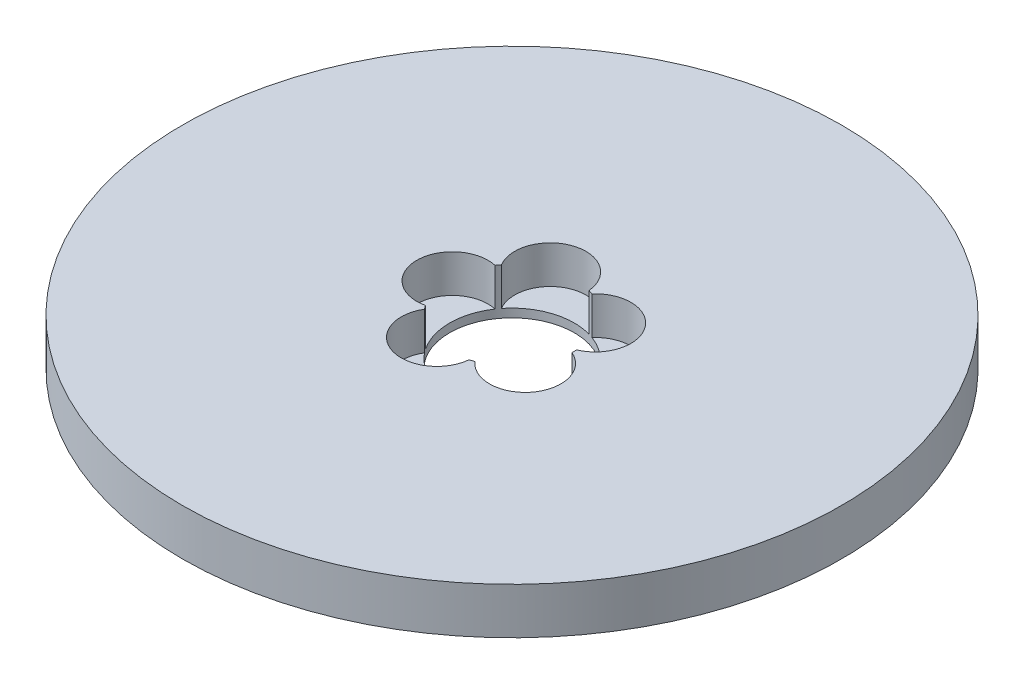
ISO-10303-21;
HEADER;
FILE_DESCRIPTION(('STEP AP214'),'2;1');
FILE_NAME('part.step','',(''),(''),'','','');
FILE_SCHEMA(('AUTOMOTIVE_DESIGN { 1 0 10303 214 1 1 1 1 }'));
ENDSEC;
DATA;
#1=APPLICATION_CONTEXT('core data for automotive mechanical design processes');
#2=APPLICATION_PROTOCOL_DEFINITION('international standard','automotive_design',2000,#1);
#3=PRODUCT_CONTEXT('',#1,'mechanical');
#4=PRODUCT('Part','Part','',(#3));
#5=PRODUCT_RELATED_PRODUCT_CATEGORY('part','',(#4));
#6=PRODUCT_DEFINITION_FORMATION('','',#4);
#7=PRODUCT_DEFINITION_CONTEXT('part definition',#1,'design');
#8=PRODUCT_DEFINITION('design','',#6,#7);
#9=PRODUCT_DEFINITION_SHAPE('','',#8);
#10=(LENGTH_UNIT() NAMED_UNIT(*) SI_UNIT(.MILLI.,.METRE.));
#11=(NAMED_UNIT(*) PLANE_ANGLE_UNIT() SI_UNIT($,.RADIAN.));
#12=(NAMED_UNIT(*) SI_UNIT($,.STERADIAN.) SOLID_ANGLE_UNIT());
#13=UNCERTAINTY_MEASURE_WITH_UNIT(LENGTH_MEASURE(1.E-05),#10,'distance_accuracy_value','');
#14=(GEOMETRIC_REPRESENTATION_CONTEXT(3) GLOBAL_UNCERTAINTY_ASSIGNED_CONTEXT((#13)) GLOBAL_UNIT_ASSIGNED_CONTEXT((#10,
#11,#12)) REPRESENTATION_CONTEXT('',''));
#15=CARTESIAN_POINT('',(0.,0.,0.));
#16=DIRECTION('',(0.,0.,1.));
#17=DIRECTION('',(1.,0.,0.));
#18=AXIS2_PLACEMENT_3D('',#15,#16,#17);
#19=CARTESIAN_POINT('',(0.,13.,0.));
#20=DIRECTION('',(0.,-1.,0.));
#21=DIRECTION('',(0.,0.,-1.));
#22=AXIS2_PLACEMENT_3D('',#19,#20,#21);
#23=CYLINDRICAL_SURFACE('',#22,92.5);
#24=CARTESIAN_POINT('',(0.,13.,0.));
#25=DIRECTION('',(0.,1.,0.));
#26=DIRECTION('',(0.,0.,1.));
#27=AXIS2_PLACEMENT_3D('',#24,#25,#26);
#28=CIRCLE('',#27,92.5);
#29=CARTESIAN_POINT('',(0.,13.,-92.5));
#30=VERTEX_POINT('',#29);
#31=EDGE_CURVE('E187',#30,#30,#28,.T.);
#32=CARTESIAN_POINT('',(0.,0.,0.));
#33=DIRECTION('',(0.,1.,0.));
#34=DIRECTION('',(0.,0.,1.));
#35=AXIS2_PLACEMENT_3D('',#32,#33,#34);
#36=CIRCLE('',#35,92.5);
#37=CARTESIAN_POINT('',(0.,0.,-92.5));
#38=VERTEX_POINT('',#37);
#39=EDGE_CURVE('E181',#38,#38,#36,.T.);
#40=CARTESIAN_POINT('',(0.,13.,-92.5));
#41=CARTESIAN_POINT('',(0.,12.8645833333333,-92.5));
#42=CARTESIAN_POINT('',(0.,12.7291666666667,-92.5));
#43=CARTESIAN_POINT('',(0.,12.4583333333333,-92.5));
#44=CARTESIAN_POINT('',(0.,12.3229166666667,-92.5));
#45=CARTESIAN_POINT('',(0.,12.0520833333333,-92.5));
#46=CARTESIAN_POINT('',(0.,11.9166666666667,-92.5));
#47=CARTESIAN_POINT('',(0.,11.6458333333333,-92.5));
#48=CARTESIAN_POINT('',(0.,11.5104166666667,-92.5));
#49=CARTESIAN_POINT('',(0.,11.2395833333333,-92.5));
#50=CARTESIAN_POINT('',(0.,11.1041666666667,-92.5));
#51=CARTESIAN_POINT('',(0.,10.8333333333333,-92.5));
#52=CARTESIAN_POINT('',(0.,10.6979166666667,-92.5));
#53=CARTESIAN_POINT('',(0.,10.4270833333333,-92.5));
#54=CARTESIAN_POINT('',(0.,10.2916666666667,-92.5));
#55=CARTESIAN_POINT('',(0.,10.0208333333333,-92.5));
#56=CARTESIAN_POINT('',(0.,9.88541666666667,-92.5));
#57=CARTESIAN_POINT('',(0.,9.61458333333333,-92.5));
#58=CARTESIAN_POINT('',(0.,9.47916666666667,-92.5));
#59=CARTESIAN_POINT('',(0.,9.20833333333333,-92.5));
#60=CARTESIAN_POINT('',(0.,9.07291666666666,-92.5));
#61=CARTESIAN_POINT('',(0.,8.80208333333333,-92.5));
#62=CARTESIAN_POINT('',(0.,8.66666666666667,-92.5));
#63=CARTESIAN_POINT('',(0.,8.39583333333333,-92.5));
#64=CARTESIAN_POINT('',(0.,8.26041666666667,-92.5));
#65=CARTESIAN_POINT('',(0.,7.98958333333333,-92.5));
#66=CARTESIAN_POINT('',(0.,7.85416666666667,-92.5));
#67=CARTESIAN_POINT('',(0.,7.58333333333333,-92.5));
#68=CARTESIAN_POINT('',(0.,7.44791666666667,-92.5));
#69=CARTESIAN_POINT('',(0.,7.17708333333333,-92.5));
#70=CARTESIAN_POINT('',(0.,7.04166666666667,-92.5));
#71=CARTESIAN_POINT('',(0.,6.77083333333333,-92.5));
#72=CARTESIAN_POINT('',(0.,6.63541666666667,-92.5));
#73=CARTESIAN_POINT('',(0.,6.36458333333333,-92.5));
#74=CARTESIAN_POINT('',(0.,6.22916666666667,-92.5));
#75=CARTESIAN_POINT('',(0.,5.95833333333333,-92.5));
#76=CARTESIAN_POINT('',(0.,5.82291666666667,-92.5));
#77=CARTESIAN_POINT('',(0.,5.55208333333333,-92.5));
#78=CARTESIAN_POINT('',(0.,5.41666666666667,-92.5));
#79=CARTESIAN_POINT('',(0.,5.14583333333333,-92.5));
#80=CARTESIAN_POINT('',(0.,5.01041666666667,-92.5));
#81=CARTESIAN_POINT('',(0.,4.73958333333333,-92.5));
#82=CARTESIAN_POINT('',(0.,4.60416666666667,-92.5));
#83=CARTESIAN_POINT('',(0.,4.33333333333333,-92.5));
#84=CARTESIAN_POINT('',(0.,4.19791666666667,-92.5));
#85=CARTESIAN_POINT('',(0.,3.92708333333333,-92.5));
#86=CARTESIAN_POINT('',(0.,3.79166666666667,-92.5));
#87=CARTESIAN_POINT('',(0.,3.52083333333333,-92.5));
#88=CARTESIAN_POINT('',(0.,3.38541666666667,-92.5));
#89=CARTESIAN_POINT('',(0.,3.11458333333333,-92.5));
#90=CARTESIAN_POINT('',(0.,2.97916666666667,-92.5));
#91=CARTESIAN_POINT('',(0.,2.70833333333333,-92.5));
#92=CARTESIAN_POINT('',(0.,2.57291666666667,-92.5));
#93=CARTESIAN_POINT('',(0.,2.30208333333333,-92.5));
#94=CARTESIAN_POINT('',(0.,2.16666666666667,-92.5));
#95=CARTESIAN_POINT('',(0.,1.89583333333333,-92.5));
#96=CARTESIAN_POINT('',(0.,1.76041666666667,-92.5));
#97=CARTESIAN_POINT('',(0.,1.48958333333333,-92.5));
#98=CARTESIAN_POINT('',(0.,1.35416666666667,-92.5));
#99=CARTESIAN_POINT('',(0.,1.08333333333333,-92.5));
#100=CARTESIAN_POINT('',(0.,0.947916666666667,-92.5));
#101=CARTESIAN_POINT('',(0.,0.677083333333334,-92.5));
#102=CARTESIAN_POINT('',(0.,0.541666666666667,-92.5));
#103=CARTESIAN_POINT('',(0.,0.270833333333334,-92.5));
#104=CARTESIAN_POINT('',(0.,0.135416666666667,-92.5));
#105=CARTESIAN_POINT('',(0.,0.,-92.5));
#106=B_SPLINE_CURVE_WITH_KNOTS('',3,(#40,#41,#42,#43,#44,#45,#46,#47,#48,#49,#50,#51,#52,#53,
#54,#55,#56,#57,#58,#59,#60,#61,#62,#63,#64,#65,#66,#67,#68,#69,#70,#71,#72,#73,#74,#75,#76,#77,
#78,#79,#80,#81,#82,#83,#84,#85,#86,#87,#88,#89,#90,#91,#92,#93,#94,#95,#96,#97,#98,#99,#100,
#101,#102,#103,#104,#105),.UNSPECIFIED.,.F.,.F.,(4,2,2,2,2,2,2,2,2,2,2,2,2,2,2,2,2,2,2,2,2,2,2,
2,2,2,2,2,2,2,2,2,4),(0.,0.40625,0.812500000000001,1.21875,1.625,2.03125,2.4375,2.84375,3.25,
3.65625,4.0625,4.46875,4.875,5.28125,5.6875,6.09375,6.5,6.90625,7.3125,7.71875,8.125,8.53125,
8.9375,9.34375,9.75,10.15625,10.5625,10.96875,11.375,11.78125,12.1875,12.59375,13.),.UNSPECIFIED.);
#107=EDGE_CURVE('BSEAM39',#30,#38,#106,.T.);
#108=ORIENTED_EDGE('',*,*,#31,.F.);
#109=ORIENTED_EDGE('',*,*,#39,.T.);
#110=ORIENTED_EDGE('',*,*,#107,.T.);
#111=ORIENTED_EDGE('',*,*,#107,.F.);
#112=EDGE_LOOP('',(#108,#110,#109,#111));
#113=FACE_BOUND('',#112,.T.);
#114=ADVANCED_FACE('F39',(#113),#23,.T.);
#115=CARTESIAN_POINT('',(0.,13.,0.));
#116=DIRECTION('',(0.,1.,0.));
#117=DIRECTION('',(0.,0.,1.));
#118=AXIS2_PLACEMENT_3D('',#115,#116,#117);
#119=PLANE('',#118);
#120=CARTESIAN_POINT('',(-5.1714823834202,13.,15.9161861942443));
#121=DIRECTION('',(0.,1.,0.));
#122=DIRECTION('',(0.951056516295155,0.,0.309016994374945));
#123=AXIS2_PLACEMENT_3D('',#120,#121,#122);
#124=CIRCLE('',#123,10.);
#125=CARTESIAN_POINT('',(-13.7663201543375,13.,10.8045559560901));
#126=VERTEX_POINT('',#125);
#127=CARTESIAN_POINT('',(4.78642830630695,13.,16.8327093502081));
#128=VERTEX_POINT('',#127);
#129=EDGE_CURVE('E171',#126,#128,#124,.T.);
#130=ORIENTED_EDGE('',*,*,#129,.F.);
#131=CARTESIAN_POINT('',(0.,13.,0.));
#132=DIRECTION('',(0.,1.,0.));
#133=DIRECTION('',(0.,0.,1.));
#134=AXIS2_PLACEMENT_3D('',#131,#132,#133);
#135=CIRCLE('',#134,17.5);
#136=CARTESIAN_POINT('',(-14.5297702254117,13.,9.75375708108115));
#137=VERTEX_POINT('',#136);
#138=EDGE_CURVE('E179',#137,#126,#135,.T.);
#139=ORIENTED_EDGE('',*,*,#138,.F.);
#140=CARTESIAN_POINT('',(-16.7352685371905,13.,0.));
#141=DIRECTION('',(0.,1.,0.));
#142=DIRECTION('',(0.,0.,1.));
#143=AXIS2_PLACEMENT_3D('',#140,#141,#142);
#144=CIRCLE('',#143,10.);
#145=CARTESIAN_POINT('',(-14.5297702254117,13.,-9.75375708108115));
#146=VERTEX_POINT('',#145);
#147=EDGE_CURVE('E173',#146,#137,#144,.T.);
#148=ORIENTED_EDGE('',*,*,#147,.F.);
#149=CARTESIAN_POINT('',(-13.7663201543377,13.,-10.8045559560899));
#150=VERTEX_POINT('',#149);
#151=EDGE_CURVE('E183',#150,#146,#135,.T.);
#152=ORIENTED_EDGE('',*,*,#151,.F.);
#153=CARTESIAN_POINT('',(-5.17148238342042,13.,-15.9161861942443));
#154=DIRECTION('',(0.,1.,0.));
#155=DIRECTION('',(-0.95105651629515,0.,0.309016994374958));
#156=AXIS2_PLACEMENT_3D('',#153,#154,#155);
#157=CIRCLE('',#156,10.);
#158=CARTESIAN_POINT('',(4.78642830630671,13.,-16.8327093502082));
#159=VERTEX_POINT('',#158);
#160=EDGE_CURVE('E58',#159,#150,#157,.T.);
#161=ORIENTED_EDGE('',*,*,#160,.F.);
#162=CARTESIAN_POINT('',(6.02171647001823,13.,-16.4313398952949));
#163=VERTEX_POINT('',#162);
#164=EDGE_CURVE('E133',#163,#159,#135,.T.);
#165=ORIENTED_EDGE('',*,*,#164,.F.);
#166=CARTESIAN_POINT('',(13.5391166520154,13.,-9.83674403931494));
#167=DIRECTION('',(0.,1.,0.));
#168=DIRECTION('',(-0.58778525229248,0.,-0.809016994374942));
#169=AXIS2_PLACEMENT_3D('',#166,#167,#168);
#170=CIRCLE('',#169,10.);
#171=CARTESIAN_POINT('',(17.4879456034239,13.,-0.649429420095788));
#172=VERTEX_POINT('',#171);
#173=EDGE_CURVE('E127',#172,#163,#170,.T.);
#174=ORIENTED_EDGE('',*,*,#173,.F.);
#175=CARTESIAN_POINT('',(17.4879456034239,13.,0.649429420095538));
#176=VERTEX_POINT('',#175);
#177=EDGE_CURVE('E376',#176,#172,#135,.T.);
#178=ORIENTED_EDGE('',*,*,#177,.F.);
#179=CARTESIAN_POINT('',(13.5391166520156,13.,9.83674403931475));
#180=DIRECTION('',(0.,1.,0.));
#181=DIRECTION('',(0.587785252292469,0.,-0.809016994374951));
#182=AXIS2_PLACEMENT_3D('',#179,#180,#181);
#183=CIRCLE('',#182,10.);
#184=CARTESIAN_POINT('',(6.02171647001847,13.,16.4313398952949));
#185=VERTEX_POINT('',#184);
#186=EDGE_CURVE('E162',#185,#176,#183,.T.);
#187=ORIENTED_EDGE('',*,*,#186,.F.);
#188=EDGE_CURVE('E184',#128,#185,#135,.T.);
#189=ORIENTED_EDGE('',*,*,#188,.F.);
#190=EDGE_LOOP('',(#130,#139,#148,#152,#161,#165,#174,#178,#187,#189));
#191=FACE_BOUND('',#190,.T.);
#192=ORIENTED_EDGE('',*,*,#31,.T.);
#193=EDGE_LOOP('',(#192));
#194=FACE_BOUND('',#193,.T.);
#195=ADVANCED_FACE('F211',(#191,#194),#119,.T.);
#196=CARTESIAN_POINT('',(0.,0.,0.));
#197=DIRECTION('',(0.,1.,0.));
#198=DIRECTION('',(0.,0.,1.));
#199=AXIS2_PLACEMENT_3D('',#196,#197,#198);
#200=PLANE('',#199);
#201=CARTESIAN_POINT('',(0.,0.,0.));
#202=DIRECTION('',(0.,1.,0.));
#203=DIRECTION('',(0.,0.,1.));
#204=AXIS2_PLACEMENT_3D('',#201,#202,#203);
#205=CIRCLE('',#204,17.5);
#206=CARTESIAN_POINT('',(0.,0.,17.5));
#207=VERTEX_POINT('',#206);
#208=EDGE_CURVE('E177',#207,#207,#205,.T.);
#209=ORIENTED_EDGE('',*,*,#208,.T.);
#210=EDGE_LOOP('',(#209));
#211=FACE_BOUND('',#210,.T.);
#212=ORIENTED_EDGE('',*,*,#39,.F.);
#213=EDGE_LOOP('',(#212));
#214=FACE_BOUND('',#213,.T.);
#215=ADVANCED_FACE('F231',(#211,#214),#200,.F.);
#216=CARTESIAN_POINT('',(0.,13.,0.));
#217=DIRECTION('',(0.,-1.,0.));
#218=DIRECTION('',(0.,0.,-1.));
#219=AXIS2_PLACEMENT_3D('',#216,#217,#218);
#220=CYLINDRICAL_SURFACE('',#219,17.5);
#221=DIRECTION('',(0.,1.,0.));
#222=VECTOR('',#221,1.);
#223=CARTESIAN_POINT('',(-13.7663201543375,7.69085922806806,10.8045559560901));
#224=LINE('',#223,#222);
#225=CARTESIAN_POINT('',(-13.7663201543375,2.38171845613613,10.8045559560901));
#226=VERTEX_POINT('',#225);
#227=EDGE_CURVE('E11',#226,#126,#224,.T.);
#228=ORIENTED_EDGE('',*,*,#227,.F.);
#229=CARTESIAN_POINT('',(0.,2.38171845613613,0.));
#230=DIRECTION('',(0.,1.,0.));
#231=DIRECTION('',(0.,0.,1.));
#232=AXIS2_PLACEMENT_3D('',#229,#230,#231);
#233=CIRCLE('',#232,17.5);
#234=CARTESIAN_POINT('',(4.78642830630695,2.38171845613613,16.8327093502081));
#235=VERTEX_POINT('',#234);
#236=EDGE_CURVE('E122',#226,#235,#233,.T.);
#237=ORIENTED_EDGE('',*,*,#236,.T.);
#238=DIRECTION('',(0.,1.,0.));
#239=VECTOR('',#238,1.);
#240=CARTESIAN_POINT('',(4.78642830630695,7.69085922806806,16.8327093502081));
#241=LINE('',#240,#239);
#242=EDGE_CURVE('E46',#128,#235,#241,.F.);
#243=ORIENTED_EDGE('',*,*,#242,.F.);
#244=ORIENTED_EDGE('',*,*,#188,.T.);
#245=DIRECTION('',(0.,1.,0.));
#246=VECTOR('',#245,1.);
#247=CARTESIAN_POINT('',(6.02171647001847,7.69085922806806,16.4313398952949));
#248=LINE('',#247,#246);
#249=CARTESIAN_POINT('',(6.02171647001847,2.38171845613613,16.4313398952949));
#250=VERTEX_POINT('',#249);
#251=EDGE_CURVE('E144',#250,#185,#248,.T.);
#252=ORIENTED_EDGE('',*,*,#251,.F.);
#253=CARTESIAN_POINT('',(17.4879456034239,2.38171845613613,0.649429420095538));
#254=VERTEX_POINT('',#253);
#255=EDGE_CURVE('E145',#250,#254,#233,.T.);
#256=ORIENTED_EDGE('',*,*,#255,.T.);
#257=DIRECTION('',(0.,1.,0.));
#258=VECTOR('',#257,1.);
#259=CARTESIAN_POINT('',(17.4879456034239,7.69085922806806,0.649429420095538));
#260=LINE('',#259,#258);
#261=EDGE_CURVE('E142',#176,#254,#260,.F.);
#262=ORIENTED_EDGE('',*,*,#261,.F.);
#263=ORIENTED_EDGE('',*,*,#177,.T.);
#264=DIRECTION('',(0.,1.,0.));
#265=VECTOR('',#264,1.);
#266=CARTESIAN_POINT('',(17.4879456034239,7.69085922806806,-0.649429420095788));
#267=LINE('',#266,#265);
#268=CARTESIAN_POINT('',(17.4879456034239,2.38171845613613,-0.649429420095788));
#269=VERTEX_POINT('',#268);
#270=EDGE_CURVE('E139',#269,#172,#267,.T.);
#271=ORIENTED_EDGE('',*,*,#270,.F.);
#272=CARTESIAN_POINT('',(6.02171647001823,2.38171845613613,-16.4313398952949));
#273=VERTEX_POINT('',#272);
#274=EDGE_CURVE('E123',#269,#273,#233,.T.);
#275=ORIENTED_EDGE('',*,*,#274,.T.);
#276=DIRECTION('',(0.,1.,0.));
#277=VECTOR('',#276,1.);
#278=CARTESIAN_POINT('',(6.02171647001823,7.69085922806806,-16.4313398952949));
#279=LINE('',#278,#277);
#280=EDGE_CURVE('E134',#163,#273,#279,.F.);
#281=ORIENTED_EDGE('',*,*,#280,.F.);
#282=ORIENTED_EDGE('',*,*,#164,.T.);
#283=DIRECTION('',(0.,1.,0.));
#284=VECTOR('',#283,1.);
#285=CARTESIAN_POINT('',(4.78642830630671,7.69085922806806,-16.8327093502082));
#286=LINE('',#285,#284);
#287=CARTESIAN_POINT('',(4.78642830630671,2.38171845613613,-16.8327093502082));
#288=VERTEX_POINT('',#287);
#289=EDGE_CURVE('E119',#288,#159,#286,.T.);
#290=ORIENTED_EDGE('',*,*,#289,.F.);
#291=CARTESIAN_POINT('',(-13.7663201543377,2.38171845613613,-10.8045559560899));
#292=VERTEX_POINT('',#291);
#293=EDGE_CURVE('E111',#288,#292,#233,.T.);
#294=ORIENTED_EDGE('',*,*,#293,.T.);
#295=DIRECTION('',(0.,1.,0.));
#296=VECTOR('',#295,1.);
#297=CARTESIAN_POINT('',(-13.7663201543377,7.69085922806806,-10.8045559560899));
#298=LINE('',#297,#296);
#299=EDGE_CURVE('E121',#150,#292,#298,.F.);
#300=ORIENTED_EDGE('',*,*,#299,.F.);
#301=ORIENTED_EDGE('',*,*,#151,.T.);
#302=DIRECTION('',(0.,1.,0.));
#303=VECTOR('',#302,1.);
#304=CARTESIAN_POINT('',(-14.5297702254117,7.69085922806806,-9.75375708108115));
#305=LINE('',#304,#303);
#306=CARTESIAN_POINT('',(-14.5297702254117,2.38171845613613,-9.75375708108115));
#307=VERTEX_POINT('',#306);
#308=EDGE_CURVE('E200',#307,#146,#305,.T.);
#309=ORIENTED_EDGE('',*,*,#308,.F.);
#310=CARTESIAN_POINT('',(0.,2.38171845613613,0.));
#311=DIRECTION('',(0.,1.,0.));
#312=DIRECTION('',(0.,0.,1.));
#313=AXIS2_PLACEMENT_3D('',#310,#311,#312);
#314=CIRCLE('',#313,17.5);
#315=CARTESIAN_POINT('',(-14.5297702254117,2.38171845613613,9.75375708108115));
#316=VERTEX_POINT('',#315);
#317=EDGE_CURVE('E191',#307,#316,#314,.T.);
#318=ORIENTED_EDGE('',*,*,#317,.T.);
#319=DIRECTION('',(0.,1.,0.));
#320=VECTOR('',#319,1.);
#321=CARTESIAN_POINT('',(-14.5297702254117,7.69085922806806,9.75375708108115));
#322=LINE('',#321,#320);
#323=EDGE_CURVE('E198',#137,#316,#322,.F.);
#324=ORIENTED_EDGE('',*,*,#323,.F.);
#325=ORIENTED_EDGE('',*,*,#138,.T.);
#326=EDGE_LOOP('',(#228,#237,#243,#244,#252,#256,#262,#263,#271,#275,#281,#282,#290,#294,#300,
#301,#309,#318,#324,#325));
#327=FACE_BOUND('',#326,.T.);
#328=ORIENTED_EDGE('',*,*,#208,.F.);
#329=EDGE_LOOP('',(#328));
#330=FACE_BOUND('',#329,.T.);
#331=ADVANCED_FACE('F128',(#327,#330),#220,.F.);
#332=CARTESIAN_POINT('',(-16.7352685371905,2.38171845613613,0.));
#333=DIRECTION('',(0.,1.,0.));
#334=DIRECTION('',(0.,0.,1.));
#335=AXIS2_PLACEMENT_3D('',#332,#333,#334);
#336=CYLINDRICAL_SURFACE('',#335,10.);
#337=ORIENTED_EDGE('',*,*,#308,.T.);
#338=ORIENTED_EDGE('',*,*,#147,.T.);
#339=ORIENTED_EDGE('',*,*,#323,.T.);
#340=CARTESIAN_POINT('',(-16.7352685371905,2.38171845613613,0.));
#341=DIRECTION('',(0.,1.,0.));
#342=DIRECTION('',(0.,0.,1.));
#343=AXIS2_PLACEMENT_3D('',#340,#341,#342);
#344=CIRCLE('',#343,10.);
#345=EDGE_CURVE('E176',#307,#316,#344,.T.);
#346=ORIENTED_EDGE('',*,*,#345,.F.);
#347=EDGE_LOOP('',(#337,#338,#339,#346));
#348=FACE_BOUND('',#347,.T.);
#349=ADVANCED_FACE('F202',(#348),#336,.F.);
#350=CARTESIAN_POINT('',(-16.7352685371905,2.38171845613613,0.));
#351=DIRECTION('',(0.,1.,0.));
#352=DIRECTION('',(0.,0.,1.));
#353=AXIS2_PLACEMENT_3D('',#350,#351,#352);
#354=PLANE('',#353);
#355=ORIENTED_EDGE('',*,*,#345,.T.);
#356=ORIENTED_EDGE('',*,*,#317,.F.);
#357=EDGE_LOOP('',(#355,#356));
#358=FACE_BOUND('',#357,.T.);
#359=ADVANCED_FACE('F214',(#358),#354,.T.);
#360=CARTESIAN_POINT('',(-5.17148238342042,2.38171845613613,-15.9161861942443));
#361=DIRECTION('',(0.,1.,0.));
#362=DIRECTION('',(0.,0.,1.));
#363=AXIS2_PLACEMENT_3D('',#360,#361,#362);
#364=CYLINDRICAL_SURFACE('',#363,10.);
#365=ORIENTED_EDGE('',*,*,#289,.T.);
#366=ORIENTED_EDGE('',*,*,#160,.T.);
#367=ORIENTED_EDGE('',*,*,#299,.T.);
#368=CARTESIAN_POINT('',(-5.17148238342042,2.38171845613613,-15.9161861942443));
#369=DIRECTION('',(0.,1.,0.));
#370=DIRECTION('',(-0.95105651629515,0.,0.309016994374958));
#371=AXIS2_PLACEMENT_3D('',#368,#369,#370);
#372=CIRCLE('',#371,10.);
#373=EDGE_CURVE('E120',#288,#292,#372,.T.);
#374=ORIENTED_EDGE('',*,*,#373,.F.);
#375=EDGE_LOOP('',(#365,#366,#367,#374));
#376=FACE_BOUND('',#375,.T.);
#377=ADVANCED_FACE('F124',(#376),#364,.F.);
#378=CARTESIAN_POINT('',(-5.1714823834202,2.38171845613613,15.9161861942443));
#379=DIRECTION('',(0.,1.,0.));
#380=DIRECTION('',(0.951056516295155,0.,0.309016994374945));
#381=AXIS2_PLACEMENT_3D('',#378,#379,#380);
#382=PLANE('',#381);
#383=ORIENTED_EDGE('',*,*,#373,.T.);
#384=ORIENTED_EDGE('',*,*,#293,.F.);
#385=EDGE_LOOP('',(#383,#384));
#386=FACE_BOUND('',#385,.T.);
#387=ADVANCED_FACE('F116',(#386),#382,.T.);
#388=CARTESIAN_POINT('',(13.5391166520154,2.38171845613613,-9.83674403931494));
#389=DIRECTION('',(0.,1.,0.));
#390=DIRECTION('',(0.,0.,1.));
#391=AXIS2_PLACEMENT_3D('',#388,#389,#390);
#392=CYLINDRICAL_SURFACE('',#391,10.);
#393=ORIENTED_EDGE('',*,*,#270,.T.);
#394=ORIENTED_EDGE('',*,*,#173,.T.);
#395=ORIENTED_EDGE('',*,*,#280,.T.);
#396=CARTESIAN_POINT('',(13.5391166520154,2.38171845613613,-9.83674403931494));
#397=DIRECTION('',(0.,1.,0.));
#398=DIRECTION('',(-0.58778525229248,0.,-0.809016994374942));
#399=AXIS2_PLACEMENT_3D('',#396,#397,#398);
#400=CIRCLE('',#399,10.);
#401=EDGE_CURVE('E157',#269,#273,#400,.T.);
#402=ORIENTED_EDGE('',*,*,#401,.F.);
#403=EDGE_LOOP('',(#393,#394,#395,#402));
#404=FACE_BOUND('',#403,.T.);
#405=ADVANCED_FACE('F161',(#404),#392,.F.);
#406=ORIENTED_EDGE('',*,*,#401,.T.);
#407=ORIENTED_EDGE('',*,*,#274,.F.);
#408=EDGE_LOOP('',(#406,#407));
#409=FACE_BOUND('',#408,.T.);
#410=ADVANCED_FACE('F158',(#409),#382,.T.);
#411=CARTESIAN_POINT('',(13.5391166520156,2.38171845613613,9.83674403931475));
#412=DIRECTION('',(0.,1.,0.));
#413=DIRECTION('',(0.,0.,1.));
#414=AXIS2_PLACEMENT_3D('',#411,#412,#413);
#415=CYLINDRICAL_SURFACE('',#414,10.);
#416=ORIENTED_EDGE('',*,*,#251,.T.);
#417=ORIENTED_EDGE('',*,*,#186,.T.);
#418=ORIENTED_EDGE('',*,*,#261,.T.);
#419=CARTESIAN_POINT('',(13.5391166520156,2.38171845613613,9.83674403931475));
#420=DIRECTION('',(0.,1.,0.));
#421=DIRECTION('',(0.587785252292469,0.,-0.809016994374951));
#422=AXIS2_PLACEMENT_3D('',#419,#420,#421);
#423=CIRCLE('',#422,10.);
#424=EDGE_CURVE('E164',#250,#254,#423,.T.);
#425=ORIENTED_EDGE('',*,*,#424,.F.);
#426=EDGE_LOOP('',(#416,#417,#418,#425));
#427=FACE_BOUND('',#426,.T.);
#428=ADVANCED_FACE('F280',(#427),#415,.F.);
#429=ORIENTED_EDGE('',*,*,#424,.T.);
#430=ORIENTED_EDGE('',*,*,#255,.F.);
#431=EDGE_LOOP('',(#429,#430));
#432=FACE_BOUND('',#431,.T.);
#433=ADVANCED_FACE('F279',(#432),#382,.T.);
#434=CARTESIAN_POINT('',(-5.1714823834202,2.38171845613613,15.9161861942443));
#435=DIRECTION('',(0.,1.,0.));
#436=DIRECTION('',(0.,0.,1.));
#437=AXIS2_PLACEMENT_3D('',#434,#435,#436);
#438=CYLINDRICAL_SURFACE('',#437,10.);
#439=ORIENTED_EDGE('',*,*,#227,.T.);
#440=ORIENTED_EDGE('',*,*,#129,.T.);
#441=ORIENTED_EDGE('',*,*,#242,.T.);
#442=CARTESIAN_POINT('',(-5.1714823834202,2.38171845613613,15.9161861942443));
#443=DIRECTION('',(0.,1.,0.));
#444=DIRECTION('',(0.951056516295155,0.,0.309016994374945));
#445=AXIS2_PLACEMENT_3D('',#442,#443,#444);
#446=CIRCLE('',#445,10.);
#447=EDGE_CURVE('E55',#226,#235,#446,.T.);
#448=ORIENTED_EDGE('',*,*,#447,.F.);
#449=EDGE_LOOP('',(#439,#440,#441,#448));
#450=FACE_BOUND('',#449,.T.);
#451=ADVANCED_FACE('F294',(#450),#438,.F.);
#452=ORIENTED_EDGE('',*,*,#447,.T.);
#453=ORIENTED_EDGE('',*,*,#236,.F.);
#454=EDGE_LOOP('',(#452,#453));
#455=FACE_BOUND('',#454,.T.);
#456=ADVANCED_FACE('F265',(#455),#382,.T.);
#457=CLOSED_SHELL('',(#114,#195,#215,#331,#349,#359,#377,#387,#405,#410,#428,#433,#451,#456));
#458=MANIFOLD_SOLID_BREP('B2',#457);
#459=ADVANCED_BREP_SHAPE_REPRESENTATION('',(#18,#458),#14);
#460=SHAPE_DEFINITION_REPRESENTATION(#9,#459);
ENDSEC;
END-ISO-10303-21;
